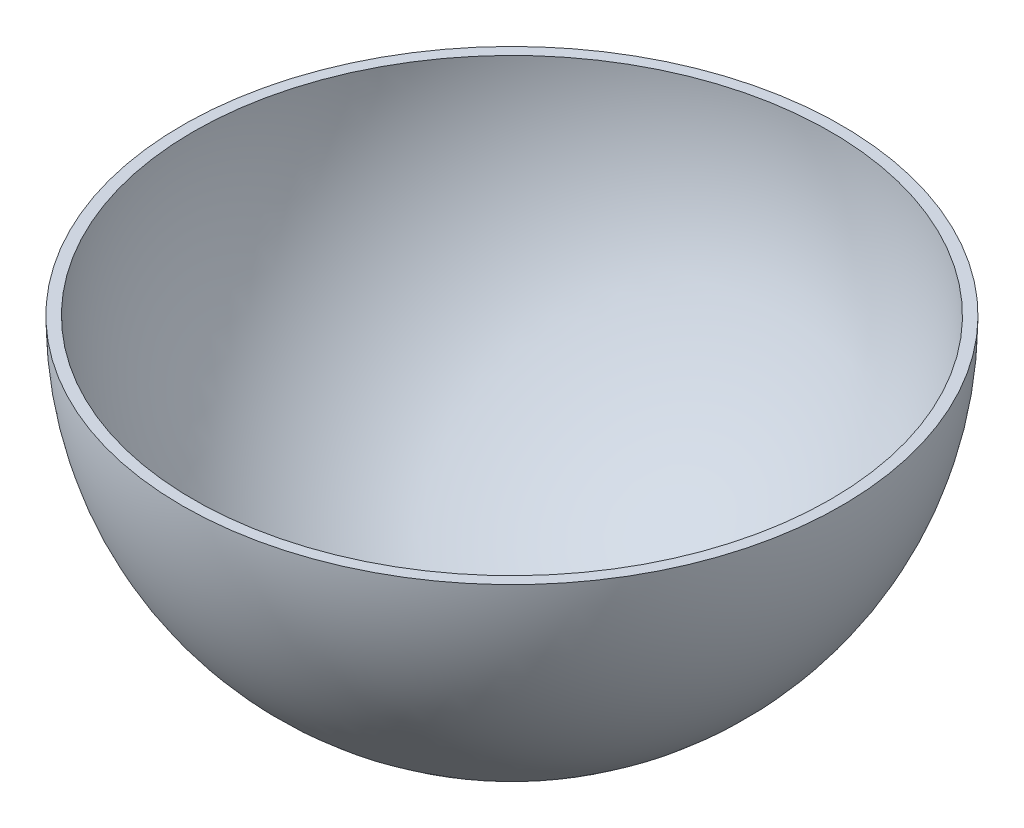
ISO-10303-21;
HEADER;
FILE_DESCRIPTION(('STEP AP214'),'2;1');
FILE_NAME('part.step','',(''),(''),'','','');
FILE_SCHEMA(('AUTOMOTIVE_DESIGN { 1 0 10303 214 1 1 1 1 }'));
ENDSEC;
DATA;
#1=APPLICATION_CONTEXT('core data for automotive mechanical design processes');
#2=APPLICATION_PROTOCOL_DEFINITION('international standard','automotive_design',2000,#1);
#3=PRODUCT_CONTEXT('',#1,'mechanical');
#4=PRODUCT('Part','Part','',(#3));
#5=PRODUCT_RELATED_PRODUCT_CATEGORY('part','',(#4));
#6=PRODUCT_DEFINITION_FORMATION('','',#4);
#7=PRODUCT_DEFINITION_CONTEXT('part definition',#1,'design');
#8=PRODUCT_DEFINITION('design','',#6,#7);
#9=PRODUCT_DEFINITION_SHAPE('','',#8);
#10=(LENGTH_UNIT() NAMED_UNIT(*) SI_UNIT(.MILLI.,.METRE.));
#11=(NAMED_UNIT(*) PLANE_ANGLE_UNIT() SI_UNIT($,.RADIAN.));
#12=(NAMED_UNIT(*) SI_UNIT($,.STERADIAN.) SOLID_ANGLE_UNIT());
#13=UNCERTAINTY_MEASURE_WITH_UNIT(LENGTH_MEASURE(1.E-05),#10,'distance_accuracy_value','');
#14=(GEOMETRIC_REPRESENTATION_CONTEXT(3) GLOBAL_UNCERTAINTY_ASSIGNED_CONTEXT((#13)) GLOBAL_UNIT_ASSIGNED_CONTEXT((#10,
#11,#12)) REPRESENTATION_CONTEXT('',''));
#15=CARTESIAN_POINT('',(0.,0.,0.));
#16=DIRECTION('',(0.,0.,1.));
#17=DIRECTION('',(1.,0.,0.));
#18=AXIS2_PLACEMENT_3D('',#15,#16,#17);
#19=CARTESIAN_POINT('',(0.,0.,0.));
#20=DIRECTION('',(0.,0.,-1.));
#21=DIRECTION('',(-1.,0.,0.));
#22=AXIS2_PLACEMENT_3D('',#19,#20,#21);
#23=SPHERICAL_SURFACE('',#22,38.1);
#24=CARTESIAN_POINT('',(0.,0.,0.));
#25=DIRECTION('',(0.,-1.,0.));
#26=DIRECTION('',(0.,0.,1.));
#27=AXIS2_PLACEMENT_3D('',#24,#25,#26);
#28=SPHERICAL_SURFACE('',#27,38.1);
#29=CARTESIAN_POINT('',(0.,0.,0.));
#30=DIRECTION('',(0.,-1.,0.));
#31=DIRECTION('',(0.,0.,1.));
#32=AXIS2_PLACEMENT_3D('',#29,#30,#31);
#33=CIRCLE('',#32,38.1);
#34=CARTESIAN_POINT('',(2.61384973715095E-13,0.,38.1));
#35=VERTEX_POINT('',#34);
#36=EDGE_CURVE('E10',#35,#35,#33,.T.);
#37=ORIENTED_EDGE('',*,*,#36,.T.);
#38=EDGE_LOOP('',(#37));
#39=FACE_BOUND('',#38,.T.);
#40=ADVANCED_FACE('F41',(#39),#28,.T.);
#41=CARTESIAN_POINT('',(0.,0.,0.));
#42=DIRECTION('',(0.,-1.,0.));
#43=DIRECTION('',(0.,0.,1.));
#44=AXIS2_PLACEMENT_3D('',#41,#42,#43);
#45=PLANE('',#44);
#46=CARTESIAN_POINT('',(0.,0.,0.));
#47=DIRECTION('',(0.,-1.,0.));
#48=DIRECTION('',(1.,0.,0.));
#49=AXIS2_PLACEMENT_3D('',#46,#47,#48);
#50=CIRCLE('',#49,36.83);
#51=CARTESIAN_POINT('',(36.83,5.1436503083837E-13,0.));
#52=VERTEX_POINT('',#51);
#53=EDGE_CURVE('E48',#52,#52,#50,.T.);
#54=ORIENTED_EDGE('',*,*,#53,.T.);
#55=EDGE_LOOP('',(#54));
#56=FACE_BOUND('',#55,.T.);
#57=ORIENTED_EDGE('',*,*,#36,.F.);
#58=EDGE_LOOP('',(#57));
#59=FACE_BOUND('',#58,.T.);
#60=ADVANCED_FACE('F55',(#56,#59),#45,.F.);
#61=CARTESIAN_POINT('',(0.,0.,0.));
#62=DIRECTION('',(0.,0.,-1.));
#63=DIRECTION('',(-1.,0.,0.));
#64=AXIS2_PLACEMENT_3D('',#61,#62,#63);
#65=SPHERICAL_SURFACE('',#64,36.83);
#66=CARTESIAN_POINT('',(0.,0.,0.));
#67=DIRECTION('',(0.,-1.,0.));
#68=DIRECTION('',(1.,0.,0.));
#69=AXIS2_PLACEMENT_3D('',#66,#67,#68);
#70=SPHERICAL_SURFACE('',#69,36.83);
#71=ORIENTED_EDGE('',*,*,#53,.F.);
#72=EDGE_LOOP('',(#71));
#73=FACE_BOUND('',#72,.T.);
#74=ADVANCED_FACE('F58',(#73),#70,.F.);
#75=CLOSED_SHELL('',(#40,#60,#74));
#76=MANIFOLD_SOLID_BREP('B2',#75);
#77=ADVANCED_BREP_SHAPE_REPRESENTATION('',(#18,#76),#14);
#78=SHAPE_DEFINITION_REPRESENTATION(#9,#77);
ENDSEC;
END-ISO-10303-21;
